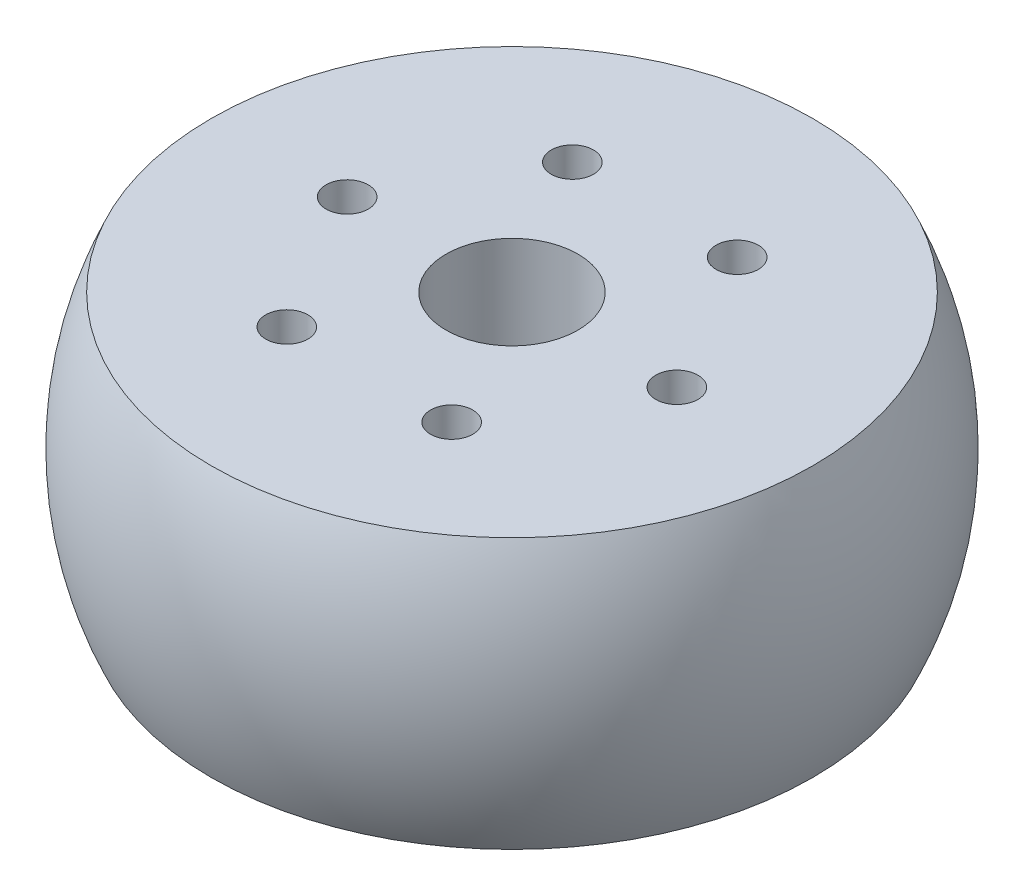
ISO-10303-21;
HEADER;
FILE_DESCRIPTION(('STEP AP214'),'2;1');
FILE_NAME('part.step','',(''),(''),'','','');
FILE_SCHEMA(('AUTOMOTIVE_DESIGN { 1 0 10303 214 1 1 1 1 }'));
ENDSEC;
DATA;
#1=APPLICATION_CONTEXT('core data for automotive mechanical design processes');
#2=APPLICATION_PROTOCOL_DEFINITION('international standard','automotive_design',2000,#1);
#3=PRODUCT_CONTEXT('',#1,'mechanical');
#4=PRODUCT('Part','Part','',(#3));
#5=PRODUCT_RELATED_PRODUCT_CATEGORY('part','',(#4));
#6=PRODUCT_DEFINITION_FORMATION('','',#4);
#7=PRODUCT_DEFINITION_CONTEXT('part definition',#1,'design');
#8=PRODUCT_DEFINITION('design','',#6,#7);
#9=PRODUCT_DEFINITION_SHAPE('','',#8);
#10=(LENGTH_UNIT() NAMED_UNIT(*) SI_UNIT(.MILLI.,.METRE.));
#11=(NAMED_UNIT(*) PLANE_ANGLE_UNIT() SI_UNIT($,.RADIAN.));
#12=(NAMED_UNIT(*) SI_UNIT($,.STERADIAN.) SOLID_ANGLE_UNIT());
#13=UNCERTAINTY_MEASURE_WITH_UNIT(LENGTH_MEASURE(1.E-05),#10,'distance_accuracy_value','');
#14=(GEOMETRIC_REPRESENTATION_CONTEXT(3) GLOBAL_UNCERTAINTY_ASSIGNED_CONTEXT((#13)) GLOBAL_UNIT_ASSIGNED_CONTEXT((#10,
#11,#12)) REPRESENTATION_CONTEXT('',''));
#15=CARTESIAN_POINT('',(0.,0.,0.));
#16=DIRECTION('',(0.,0.,1.));
#17=DIRECTION('',(1.,0.,0.));
#18=AXIS2_PLACEMENT_3D('',#15,#16,#17);
#19=CARTESIAN_POINT('',(0.,-6.5,0.));
#20=DIRECTION('',(0.,-1.,0.));
#21=DIRECTION('',(0.,0.,-1.));
#22=AXIS2_PLACEMENT_3D('',#19,#20,#21);
#23=CYLINDRICAL_SURFACE('',#22,3.175);
#24=CARTESIAN_POINT('',(0.,-6.5,0.));
#25=DIRECTION('',(0.,-1.,0.));
#26=DIRECTION('',(0.,0.,-1.));
#27=AXIS2_PLACEMENT_3D('',#24,#25,#26);
#28=CIRCLE('',#27,3.175);
#29=CARTESIAN_POINT('',(0.,-6.5,-3.175));
#30=VERTEX_POINT('',#29);
#31=EDGE_CURVE('E49',#30,#30,#28,.T.);
#32=ORIENTED_EDGE('',*,*,#31,.T.);
#33=EDGE_LOOP('',(#32));
#34=FACE_BOUND('',#33,.T.);
#35=CARTESIAN_POINT('',(0.,6.5,0.));
#36=DIRECTION('',(0.,-1.,0.));
#37=DIRECTION('',(0.,0.,-1.));
#38=AXIS2_PLACEMENT_3D('',#35,#36,#37);
#39=CIRCLE('',#38,3.175);
#40=CARTESIAN_POINT('',(0.,6.5,-3.175));
#41=VERTEX_POINT('',#40);
#42=EDGE_CURVE('E10',#41,#41,#39,.T.);
#43=ORIENTED_EDGE('',*,*,#42,.F.);
#44=EDGE_LOOP('',(#43));
#45=FACE_BOUND('',#44,.T.);
#46=ADVANCED_FACE('F35',(#34,#45),#23,.F.);
#47=CARTESIAN_POINT('',(0.,6.5,-3.175));
#48=DIRECTION('',(0.,1.,0.));
#49=DIRECTION('',(0.,0.,1.));
#50=AXIS2_PLACEMENT_3D('',#47,#48,#49);
#51=PLANE('',#50);
#52=CARTESIAN_POINT('',(3.96875000000008,6.5,6.87407664253894));
#53=DIRECTION('',(0.,1.,0.));
#54=DIRECTION('',(-0.866025403784433,0.,0.50000000000001));
#55=AXIS2_PLACEMENT_3D('',#52,#53,#54);
#56=CIRCLE('',#55,1.016);
#57=CARTESIAN_POINT('',(3.0888681897551,6.5,7.38207664253895));
#58=VERTEX_POINT('',#57);
#59=EDGE_CURVE('E71',#58,#58,#56,.T.);
#60=ORIENTED_EDGE('',*,*,#59,.F.);
#61=EDGE_LOOP('',(#60));
#62=FACE_BOUND('',#61,.T.);
#63=CARTESIAN_POINT('',(-3.96874999999994,6.50000000000001,6.87407664253902));
#64=DIRECTION('',(0.,1.,0.));
#65=DIRECTION('',(-0.866025403784443,0.,-0.499999999999992));
#66=AXIS2_PLACEMENT_3D('',#63,#64,#65);
#67=CIRCLE('',#66,1.016);
#68=CARTESIAN_POINT('',(-4.84863181024493,6.50000000000001,6.36607664253903));
#69=VERTEX_POINT('',#68);
#70=EDGE_CURVE('E70',#69,#69,#67,.T.);
#71=ORIENTED_EDGE('',*,*,#70,.F.);
#72=EDGE_LOOP('',(#71));
#73=FACE_BOUND('',#72,.T.);
#74=CARTESIAN_POINT('',(-7.9375,6.50000000000001,0.));
#75=DIRECTION('',(0.,1.,0.));
#76=DIRECTION('',(0.,0.,-1.));
#77=AXIS2_PLACEMENT_3D('',#74,#75,#76);
#78=CIRCLE('',#77,1.016);
#79=CARTESIAN_POINT('',(-7.9375,6.50000000000001,-1.016));
#80=VERTEX_POINT('',#79);
#81=EDGE_CURVE('E77',#80,#80,#78,.T.);
#82=ORIENTED_EDGE('',*,*,#81,.F.);
#83=EDGE_LOOP('',(#82));
#84=FACE_BOUND('',#83,.T.);
#85=CARTESIAN_POINT('',(-3.96875000000003,6.50000000000001,-6.87407664253896));
#86=DIRECTION('',(0.,1.,0.));
#87=DIRECTION('',(0.866025403784436,0.,-0.500000000000004));
#88=AXIS2_PLACEMENT_3D('',#85,#86,#87);
#89=CIRCLE('',#88,1.016);
#90=CARTESIAN_POINT('',(-3.08886818975505,6.50000000000001,-7.38207664253897));
#91=VERTEX_POINT('',#90);
#92=EDGE_CURVE('E83',#91,#91,#89,.T.);
#93=ORIENTED_EDGE('',*,*,#92,.F.);
#94=EDGE_LOOP('',(#93));
#95=FACE_BOUND('',#94,.T.);
#96=CARTESIAN_POINT('',(3.96874999999998,6.50000000000001,-6.87407664253899));
#97=DIRECTION('',(0.,1.,0.));
#98=DIRECTION('',(0.86602540378444,0.,0.499999999999998));
#99=AXIS2_PLACEMENT_3D('',#96,#97,#98);
#100=CIRCLE('',#99,1.016);
#101=CARTESIAN_POINT('',(4.84863181024497,6.50000000000001,-6.36607664253899));
#102=VERTEX_POINT('',#101);
#103=EDGE_CURVE('E63',#102,#102,#100,.T.);
#104=ORIENTED_EDGE('',*,*,#103,.F.);
#105=EDGE_LOOP('',(#104));
#106=FACE_BOUND('',#105,.T.);
#107=CARTESIAN_POINT('',(7.9375,6.5,0.));
#108=DIRECTION('',(0.,1.,0.));
#109=DIRECTION('',(0.,0.,1.));
#110=AXIS2_PLACEMENT_3D('',#107,#108,#109);
#111=CIRCLE('',#110,1.016);
#112=CARTESIAN_POINT('',(7.9375,6.5,1.016));
#113=VERTEX_POINT('',#112);
#114=EDGE_CURVE('E57',#113,#113,#111,.T.);
#115=ORIENTED_EDGE('',*,*,#114,.F.);
#116=EDGE_LOOP('',(#115));
#117=FACE_BOUND('',#116,.T.);
#118=ORIENTED_EDGE('',*,*,#42,.T.);
#119=EDGE_LOOP('',(#118));
#120=FACE_BOUND('',#119,.T.);
#121=CARTESIAN_POINT('',(0.,6.5,0.));
#122=DIRECTION('',(0.,-1.,0.));
#123=DIRECTION('',(0.,0.,-1.));
#124=AXIS2_PLACEMENT_3D('',#121,#122,#123);
#125=CIRCLE('',#124,14.4832877828206);
#126=CARTESIAN_POINT('',(0.,6.5,-14.4832877828206));
#127=VERTEX_POINT('',#126);
#128=EDGE_CURVE('E41',#127,#127,#125,.T.);
#129=ORIENTED_EDGE('',*,*,#128,.F.);
#130=EDGE_LOOP('',(#129));
#131=FACE_BOUND('',#130,.T.);
#132=ADVANCED_FACE('F93',(#62,#73,#84,#95,#106,#117,#120,#131),#51,.T.);
#133=CARTESIAN_POINT('',(0.,0.,0.));
#134=DIRECTION('',(0.,-1.,0.));
#135=DIRECTION('',(0.,0.,-1.));
#136=AXIS2_PLACEMENT_3D('',#133,#134,#135);
#137=SPHERICAL_SURFACE('',#136,15.875);
#138=ORIENTED_EDGE('',*,*,#128,.T.);
#139=EDGE_LOOP('',(#138));
#140=FACE_BOUND('',#139,.T.);
#141=CARTESIAN_POINT('',(0.,-6.5,0.));
#142=DIRECTION('',(0.,-1.,0.));
#143=DIRECTION('',(0.,0.,-1.));
#144=AXIS2_PLACEMENT_3D('',#141,#142,#143);
#145=CIRCLE('',#144,14.4832877828206);
#146=CARTESIAN_POINT('',(0.,-6.5,-14.4832877828206));
#147=VERTEX_POINT('',#146);
#148=EDGE_CURVE('E45',#147,#147,#145,.T.);
#149=ORIENTED_EDGE('',*,*,#148,.F.);
#150=EDGE_LOOP('',(#149));
#151=FACE_BOUND('',#150,.T.);
#152=ADVANCED_FACE('F96',(#140,#151),#137,.T.);
#153=CARTESIAN_POINT('',(0.,-6.5,-3.175));
#154=DIRECTION('',(0.,-1.,0.));
#155=DIRECTION('',(0.,0.,-1.));
#156=AXIS2_PLACEMENT_3D('',#153,#154,#155);
#157=PLANE('',#156);
#158=CARTESIAN_POINT('',(3.96875000000008,-6.5,6.87407664253894));
#159=DIRECTION('',(0.,1.,0.));
#160=DIRECTION('',(-0.866025403784433,0.,0.50000000000001));
#161=AXIS2_PLACEMENT_3D('',#158,#159,#160);
#162=CIRCLE('',#161,1.016);
#163=CARTESIAN_POINT('',(3.08886818975509,-6.5,7.38207664253895));
#164=VERTEX_POINT('',#163);
#165=EDGE_CURVE('E67',#164,#164,#162,.T.);
#166=ORIENTED_EDGE('',*,*,#165,.T.);
#167=EDGE_LOOP('',(#166));
#168=FACE_BOUND('',#167,.T.);
#169=CARTESIAN_POINT('',(-3.96874999999994,-6.50000000000001,6.87407664253902));
#170=DIRECTION('',(0.,1.,0.));
#171=DIRECTION('',(-0.866025403784443,0.,-0.499999999999992));
#172=AXIS2_PLACEMENT_3D('',#169,#170,#171);
#173=CIRCLE('',#172,1.016);
#174=CARTESIAN_POINT('',(-4.84863181024493,-6.50000000000001,6.36607664253902));
#175=VERTEX_POINT('',#174);
#176=EDGE_CURVE('E74',#175,#175,#173,.T.);
#177=ORIENTED_EDGE('',*,*,#176,.T.);
#178=EDGE_LOOP('',(#177));
#179=FACE_BOUND('',#178,.T.);
#180=CARTESIAN_POINT('',(-7.9375,-6.5,0.));
#181=DIRECTION('',(0.,1.,0.));
#182=DIRECTION('',(0.,0.,-1.));
#183=AXIS2_PLACEMENT_3D('',#180,#181,#182);
#184=CIRCLE('',#183,1.016);
#185=CARTESIAN_POINT('',(-7.9375,-6.5,-1.016));
#186=VERTEX_POINT('',#185);
#187=EDGE_CURVE('E80',#186,#186,#184,.T.);
#188=ORIENTED_EDGE('',*,*,#187,.T.);
#189=EDGE_LOOP('',(#188));
#190=FACE_BOUND('',#189,.T.);
#191=CARTESIAN_POINT('',(-3.96875000000003,-6.50000000000001,-6.87407664253897));
#192=DIRECTION('',(0.,1.,0.));
#193=DIRECTION('',(0.866025403784436,0.,-0.500000000000004));
#194=AXIS2_PLACEMENT_3D('',#191,#192,#193);
#195=CIRCLE('',#194,1.016);
#196=CARTESIAN_POINT('',(-3.08886818975504,-6.50000000000001,-7.38207664253897));
#197=VERTEX_POINT('',#196);
#198=EDGE_CURVE('E66',#197,#197,#195,.T.);
#199=ORIENTED_EDGE('',*,*,#198,.T.);
#200=EDGE_LOOP('',(#199));
#201=FACE_BOUND('',#200,.T.);
#202=CARTESIAN_POINT('',(3.96874999999999,-6.5,-6.87407664253899));
#203=DIRECTION('',(0.,1.,0.));
#204=DIRECTION('',(0.86602540378444,0.,0.499999999999998));
#205=AXIS2_PLACEMENT_3D('',#202,#203,#204);
#206=CIRCLE('',#205,1.016);
#207=CARTESIAN_POINT('',(4.84863181024498,-6.5,-6.36607664253899));
#208=VERTEX_POINT('',#207);
#209=EDGE_CURVE('E60',#208,#208,#206,.T.);
#210=ORIENTED_EDGE('',*,*,#209,.T.);
#211=EDGE_LOOP('',(#210));
#212=FACE_BOUND('',#211,.T.);
#213=CARTESIAN_POINT('',(7.9375,-6.5,0.));
#214=DIRECTION('',(0.,1.,0.));
#215=DIRECTION('',(0.,0.,1.));
#216=AXIS2_PLACEMENT_3D('',#213,#214,#215);
#217=CIRCLE('',#216,1.016);
#218=CARTESIAN_POINT('',(7.9375,-6.5,1.016));
#219=VERTEX_POINT('',#218);
#220=EDGE_CURVE('E54',#219,#219,#217,.T.);
#221=ORIENTED_EDGE('',*,*,#220,.T.);
#222=EDGE_LOOP('',(#221));
#223=FACE_BOUND('',#222,.T.);
#224=ORIENTED_EDGE('',*,*,#148,.T.);
#225=EDGE_LOOP('',(#224));
#226=FACE_BOUND('',#225,.T.);
#227=ORIENTED_EDGE('',*,*,#31,.F.);
#228=EDGE_LOOP('',(#227));
#229=FACE_BOUND('',#228,.T.);
#230=ADVANCED_FACE('F106',(#168,#179,#190,#201,#212,#223,#226,#229),#157,.T.);
#231=CARTESIAN_POINT('',(7.9375,-6.5,0.));
#232=DIRECTION('',(0.,1.,0.));
#233=DIRECTION('',(0.,0.,1.));
#234=AXIS2_PLACEMENT_3D('',#231,#232,#233);
#235=CYLINDRICAL_SURFACE('',#234,1.016);
#236=ORIENTED_EDGE('',*,*,#220,.F.);
#237=EDGE_LOOP('',(#236));
#238=FACE_BOUND('',#237,.T.);
#239=ORIENTED_EDGE('',*,*,#114,.T.);
#240=EDGE_LOOP('',(#239));
#241=FACE_BOUND('',#240,.T.);
#242=ADVANCED_FACE('F103',(#238,#241),#235,.F.);
#243=CARTESIAN_POINT('',(3.96874999999999,-6.5,-6.87407664253899));
#244=DIRECTION('',(0.,1.,0.));
#245=DIRECTION('',(-1.,0.,0.));
#246=AXIS2_PLACEMENT_3D('',#243,#244,#245);
#247=CYLINDRICAL_SURFACE('',#246,1.016);
#248=ORIENTED_EDGE('',*,*,#209,.F.);
#249=EDGE_LOOP('',(#248));
#250=FACE_BOUND('',#249,.T.);
#251=ORIENTED_EDGE('',*,*,#103,.T.);
#252=EDGE_LOOP('',(#251));
#253=FACE_BOUND('',#252,.T.);
#254=ADVANCED_FACE('F105',(#250,#253),#247,.F.);
#255=CARTESIAN_POINT('',(-3.96875000000003,-6.50000000000001,-6.87407664253897));
#256=DIRECTION('',(0.,1.,0.));
#257=DIRECTION('',(0.,0.,1.));
#258=AXIS2_PLACEMENT_3D('',#255,#256,#257);
#259=CYLINDRICAL_SURFACE('',#258,1.016);
#260=ORIENTED_EDGE('',*,*,#198,.F.);
#261=EDGE_LOOP('',(#260));
#262=FACE_BOUND('',#261,.T.);
#263=ORIENTED_EDGE('',*,*,#92,.T.);
#264=EDGE_LOOP('',(#263));
#265=FACE_BOUND('',#264,.T.);
#266=ADVANCED_FACE('F91',(#262,#265),#259,.F.);
#267=CARTESIAN_POINT('',(-7.9375,-6.5,0.));
#268=DIRECTION('',(0.,1.,0.));
#269=DIRECTION('',(0.,0.,1.));
#270=AXIS2_PLACEMENT_3D('',#267,#268,#269);
#271=CYLINDRICAL_SURFACE('',#270,1.016);
#272=ORIENTED_EDGE('',*,*,#187,.F.);
#273=EDGE_LOOP('',(#272));
#274=FACE_BOUND('',#273,.T.);
#275=ORIENTED_EDGE('',*,*,#81,.T.);
#276=EDGE_LOOP('',(#275));
#277=FACE_BOUND('',#276,.T.);
#278=ADVANCED_FACE('F157',(#274,#277),#271,.F.);
#279=CARTESIAN_POINT('',(-3.96874999999994,-6.50000000000001,6.87407664253902));
#280=DIRECTION('',(0.,1.,0.));
#281=DIRECTION('',(0.,0.,1.));
#282=AXIS2_PLACEMENT_3D('',#279,#280,#281);
#283=CYLINDRICAL_SURFACE('',#282,1.016);
#284=ORIENTED_EDGE('',*,*,#176,.F.);
#285=EDGE_LOOP('',(#284));
#286=FACE_BOUND('',#285,.T.);
#287=ORIENTED_EDGE('',*,*,#70,.T.);
#288=EDGE_LOOP('',(#287));
#289=FACE_BOUND('',#288,.T.);
#290=ADVANCED_FACE('F167',(#286,#289),#283,.F.);
#291=CARTESIAN_POINT('',(3.96875000000008,-6.5,6.87407664253894));
#292=DIRECTION('',(0.,1.,0.));
#293=DIRECTION('',(-1.,0.,0.));
#294=AXIS2_PLACEMENT_3D('',#291,#292,#293);
#295=CYLINDRICAL_SURFACE('',#294,1.016);
#296=ORIENTED_EDGE('',*,*,#165,.F.);
#297=EDGE_LOOP('',(#296));
#298=FACE_BOUND('',#297,.T.);
#299=ORIENTED_EDGE('',*,*,#59,.T.);
#300=EDGE_LOOP('',(#299));
#301=FACE_BOUND('',#300,.T.);
#302=ADVANCED_FACE('F177',(#298,#301),#295,.F.);
#303=CLOSED_SHELL('',(#46,#132,#152,#230,#242,#254,#266,#278,#290,#302));
#304=MANIFOLD_SOLID_BREP('B2',#303);
#305=ADVANCED_BREP_SHAPE_REPRESENTATION('',(#18,#304),#14);
#306=SHAPE_DEFINITION_REPRESENTATION(#9,#305);
ENDSEC;
END-ISO-10303-21;
